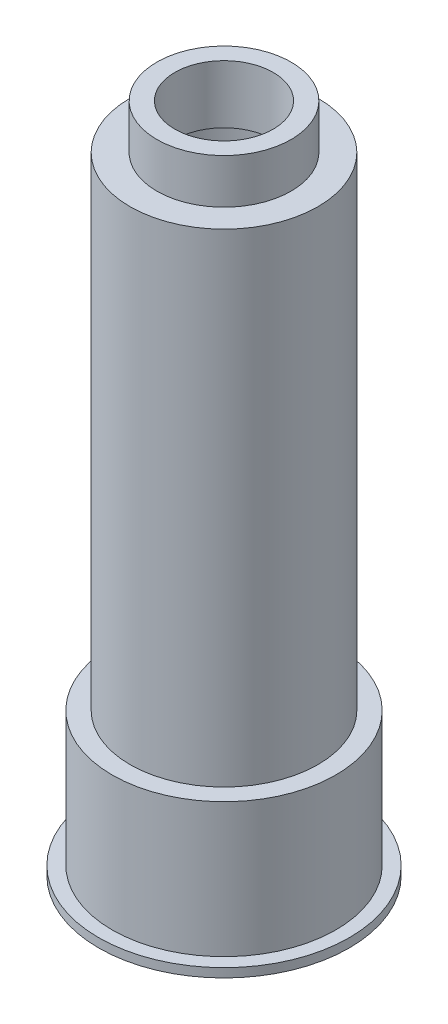
ISO-10303-21;
HEADER;
FILE_DESCRIPTION(('STEP AP214'),'2;1');
FILE_NAME('part.step','',(''),(''),'','','');
FILE_SCHEMA(('AUTOMOTIVE_DESIGN { 1 0 10303 214 1 1 1 1 }'));
ENDSEC;
DATA;
#1=APPLICATION_CONTEXT('core data for automotive mechanical design processes');
#2=APPLICATION_PROTOCOL_DEFINITION('international standard','automotive_design',2000,#1);
#3=PRODUCT_CONTEXT('',#1,'mechanical');
#4=PRODUCT('Part','Part','',(#3));
#5=PRODUCT_RELATED_PRODUCT_CATEGORY('part','',(#4));
#6=PRODUCT_DEFINITION_FORMATION('','',#4);
#7=PRODUCT_DEFINITION_CONTEXT('part definition',#1,'design');
#8=PRODUCT_DEFINITION('design','',#6,#7);
#9=PRODUCT_DEFINITION_SHAPE('','',#8);
#10=(LENGTH_UNIT() NAMED_UNIT(*) SI_UNIT(.MILLI.,.METRE.));
#11=(NAMED_UNIT(*) PLANE_ANGLE_UNIT() SI_UNIT($,.RADIAN.));
#12=(NAMED_UNIT(*) SI_UNIT($,.STERADIAN.) SOLID_ANGLE_UNIT());
#13=UNCERTAINTY_MEASURE_WITH_UNIT(LENGTH_MEASURE(1.E-05),#10,'distance_accuracy_value','');
#14=(GEOMETRIC_REPRESENTATION_CONTEXT(3) GLOBAL_UNCERTAINTY_ASSIGNED_CONTEXT((#13)) GLOBAL_UNIT_ASSIGNED_CONTEXT((#10,
#11,#12)) REPRESENTATION_CONTEXT('',''));
#15=CARTESIAN_POINT('',(0.,0.,0.));
#16=DIRECTION('',(0.,0.,1.));
#17=DIRECTION('',(1.,0.,0.));
#18=AXIS2_PLACEMENT_3D('',#15,#16,#17);
#19=CARTESIAN_POINT('',(0.,70.,0.));
#20=DIRECTION('',(0.,1.,0.));
#21=DIRECTION('',(0.,0.,1.));
#22=AXIS2_PLACEMENT_3D('',#19,#20,#21);
#23=PLANE('',#22);
#24=CARTESIAN_POINT('',(0.,70.,0.));
#25=DIRECTION('',(0.,1.,0.));
#26=DIRECTION('',(0.,0.,1.));
#27=AXIS2_PLACEMENT_3D('',#24,#25,#26);
#28=CIRCLE('',#27,10.5);
#29=CARTESIAN_POINT('',(0.,70.,10.5));
#30=VERTEX_POINT('',#29);
#31=EDGE_CURVE('E53',#30,#30,#28,.T.);
#32=ORIENTED_EDGE('',*,*,#31,.T.);
#33=EDGE_LOOP('',(#32));
#34=FACE_BOUND('',#33,.T.);
#35=CARTESIAN_POINT('',(0.,70.,0.));
#36=DIRECTION('',(0.,1.,0.));
#37=DIRECTION('',(0.,0.,1.));
#38=AXIS2_PLACEMENT_3D('',#35,#36,#37);
#39=CIRCLE('',#38,7.5);
#40=CARTESIAN_POINT('',(0.,70.,7.5));
#41=VERTEX_POINT('',#40);
#42=EDGE_CURVE('E71',#41,#41,#39,.T.);
#43=ORIENTED_EDGE('',*,*,#42,.F.);
#44=EDGE_LOOP('',(#43));
#45=FACE_BOUND('',#44,.T.);
#46=ADVANCED_FACE('F33',(#34,#45),#23,.T.);
#47=CARTESIAN_POINT('',(0.,70.,0.));
#48=DIRECTION('',(0.,-1.,0.));
#49=DIRECTION('',(0.,0.,-1.));
#50=AXIS2_PLACEMENT_3D('',#47,#48,#49);
#51=CYLINDRICAL_SURFACE('',#50,8.5);
#52=CARTESIAN_POINT('',(0.,14.5,0.));
#53=DIRECTION('',(0.,1.,0.));
#54=DIRECTION('',(0.,0.,1.));
#55=AXIS2_PLACEMENT_3D('',#52,#53,#54);
#56=CIRCLE('',#55,8.5);
#57=CARTESIAN_POINT('',(0.,14.5,8.5));
#58=VERTEX_POINT('',#57);
#59=EDGE_CURVE('E59',#58,#58,#56,.T.);
#60=ORIENTED_EDGE('',*,*,#59,.F.);
#61=EDGE_LOOP('',(#60));
#62=FACE_BOUND('',#61,.T.);
#63=CARTESIAN_POINT('',(0.,68.5,0.));
#64=DIRECTION('',(0.,1.,0.));
#65=DIRECTION('',(0.,0.,1.));
#66=AXIS2_PLACEMENT_3D('',#63,#64,#65);
#67=CIRCLE('',#66,8.5);
#68=CARTESIAN_POINT('',(0.,68.5,8.5));
#69=VERTEX_POINT('',#68);
#70=EDGE_CURVE('E62',#69,#69,#67,.T.);
#71=ORIENTED_EDGE('',*,*,#70,.T.);
#72=EDGE_LOOP('',(#71));
#73=FACE_BOUND('',#72,.T.);
#74=ADVANCED_FACE('F95',(#62,#73),#51,.F.);
#75=CARTESIAN_POINT('',(0.,16.,0.));
#76=DIRECTION('',(0.,-1.,0.));
#77=DIRECTION('',(0.,0.,-1.));
#78=AXIS2_PLACEMENT_3D('',#75,#76,#77);
#79=CYLINDRICAL_SURFACE('',#78,10.5);
#80=CARTESIAN_POINT('',(0.,1.,0.));
#81=DIRECTION('',(0.,1.,0.));
#82=DIRECTION('',(0.,0.,1.));
#83=AXIS2_PLACEMENT_3D('',#80,#81,#82);
#84=CIRCLE('',#83,10.5);
#85=CARTESIAN_POINT('',(0.,1.,10.5));
#86=VERTEX_POINT('',#85);
#87=EDGE_CURVE('E48',#86,#86,#84,.T.);
#88=ORIENTED_EDGE('',*,*,#87,.F.);
#89=EDGE_LOOP('',(#88));
#90=FACE_BOUND('',#89,.T.);
#91=CARTESIAN_POINT('',(0.,14.5,0.));
#92=DIRECTION('',(0.,1.,0.));
#93=DIRECTION('',(0.,0.,1.));
#94=AXIS2_PLACEMENT_3D('',#91,#92,#93);
#95=CIRCLE('',#94,10.5);
#96=CARTESIAN_POINT('',(0.,14.5,10.5));
#97=VERTEX_POINT('',#96);
#98=EDGE_CURVE('E56',#97,#97,#95,.T.);
#99=ORIENTED_EDGE('',*,*,#98,.T.);
#100=EDGE_LOOP('',(#99));
#101=FACE_BOUND('',#100,.T.);
#102=ADVANCED_FACE('F102',(#90,#101),#79,.F.);
#103=CARTESIAN_POINT('',(0.,16.,0.));
#104=DIRECTION('',(0.,1.,0.));
#105=DIRECTION('',(0.,0.,1.));
#106=AXIS2_PLACEMENT_3D('',#103,#104,#105);
#107=PLANE('',#106);
#108=CARTESIAN_POINT('',(0.,16.,0.));
#109=DIRECTION('',(0.,1.,0.));
#110=DIRECTION('',(0.,0.,1.));
#111=AXIS2_PLACEMENT_3D('',#108,#109,#110);
#112=CIRCLE('',#111,12.5);
#113=CARTESIAN_POINT('',(0.,16.,12.5));
#114=VERTEX_POINT('',#113);
#115=EDGE_CURVE('E11',#114,#114,#112,.T.);
#116=ORIENTED_EDGE('',*,*,#115,.T.);
#117=EDGE_LOOP('',(#116));
#118=FACE_BOUND('',#117,.T.);
#119=CARTESIAN_POINT('',(0.,16.,0.));
#120=DIRECTION('',(0.,1.,0.));
#121=DIRECTION('',(0.,0.,1.));
#122=AXIS2_PLACEMENT_3D('',#119,#120,#121);
#123=CIRCLE('',#122,10.5);
#124=CARTESIAN_POINT('',(0.,16.,10.5));
#125=VERTEX_POINT('',#124);
#126=EDGE_CURVE('E44',#125,#125,#123,.T.);
#127=ORIENTED_EDGE('',*,*,#126,.F.);
#128=EDGE_LOOP('',(#127));
#129=FACE_BOUND('',#128,.T.);
#130=ADVANCED_FACE('F115',(#118,#129),#107,.T.);
#131=CARTESIAN_POINT('',(0.,1.,0.));
#132=DIRECTION('',(0.,1.,0.));
#133=DIRECTION('',(0.,0.,1.));
#134=AXIS2_PLACEMENT_3D('',#131,#132,#133);
#135=PLANE('',#134);
#136=CARTESIAN_POINT('',(0.,1.,0.));
#137=DIRECTION('',(0.,1.,0.));
#138=DIRECTION('',(0.,0.,1.));
#139=AXIS2_PLACEMENT_3D('',#136,#137,#138);
#140=CIRCLE('',#139,12.5);
#141=CARTESIAN_POINT('',(0.,1.,12.5));
#142=VERTEX_POINT('',#141);
#143=EDGE_CURVE('E40',#142,#142,#140,.T.);
#144=ORIENTED_EDGE('',*,*,#143,.F.);
#145=EDGE_LOOP('',(#144));
#146=FACE_BOUND('',#145,.T.);
#147=ORIENTED_EDGE('',*,*,#87,.T.);
#148=EDGE_LOOP('',(#147));
#149=FACE_BOUND('',#148,.T.);
#150=ADVANCED_FACE('F117',(#146,#149),#135,.F.);
#151=CARTESIAN_POINT('',(0.,16.,0.));
#152=DIRECTION('',(0.,-1.,0.));
#153=DIRECTION('',(0.,0.,-1.));
#154=AXIS2_PLACEMENT_3D('',#151,#152,#153);
#155=CYLINDRICAL_SURFACE('',#154,12.5);
#156=ORIENTED_EDGE('',*,*,#115,.F.);
#157=EDGE_LOOP('',(#156));
#158=FACE_BOUND('',#157,.T.);
#159=ORIENTED_EDGE('',*,*,#143,.T.);
#160=EDGE_LOOP('',(#159));
#161=FACE_BOUND('',#160,.T.);
#162=ADVANCED_FACE('F35',(#158,#161),#155,.T.);
#163=CARTESIAN_POINT('',(0.,14.5,0.));
#164=DIRECTION('',(0.,1.,0.));
#165=DIRECTION('',(0.,0.,1.));
#166=AXIS2_PLACEMENT_3D('',#163,#164,#165);
#167=PLANE('',#166);
#168=ORIENTED_EDGE('',*,*,#98,.F.);
#169=EDGE_LOOP('',(#168));
#170=FACE_BOUND('',#169,.T.);
#171=ORIENTED_EDGE('',*,*,#59,.T.);
#172=EDGE_LOOP('',(#171));
#173=FACE_BOUND('',#172,.T.);
#174=ADVANCED_FACE('F108',(#170,#173),#167,.F.);
#175=CARTESIAN_POINT('',(0.,70.,0.));
#176=DIRECTION('',(0.,-1.,0.));
#177=DIRECTION('',(0.,0.,-1.));
#178=AXIS2_PLACEMENT_3D('',#175,#176,#177);
#179=CYLINDRICAL_SURFACE('',#178,10.5);
#180=ORIENTED_EDGE('',*,*,#126,.T.);
#181=EDGE_LOOP('',(#180));
#182=FACE_BOUND('',#181,.T.);
#183=ORIENTED_EDGE('',*,*,#31,.F.);
#184=EDGE_LOOP('',(#183));
#185=FACE_BOUND('',#184,.T.);
#186=ADVANCED_FACE('F109',(#182,#185),#179,.T.);
#187=CARTESIAN_POINT('',(0.,68.5,0.));
#188=DIRECTION('',(0.,1.,0.));
#189=DIRECTION('',(0.,0.,1.));
#190=AXIS2_PLACEMENT_3D('',#187,#188,#189);
#191=PLANE('',#190);
#192=ORIENTED_EDGE('',*,*,#70,.F.);
#193=EDGE_LOOP('',(#192));
#194=FACE_BOUND('',#193,.T.);
#195=CARTESIAN_POINT('',(0.,68.5,0.));
#196=DIRECTION('',(0.,1.,0.));
#197=DIRECTION('',(0.,0.,1.));
#198=AXIS2_PLACEMENT_3D('',#195,#196,#197);
#199=CIRCLE('',#198,5.5);
#200=CARTESIAN_POINT('',(0.,68.5,5.5));
#201=VERTEX_POINT('',#200);
#202=EDGE_CURVE('E65',#201,#201,#199,.T.);
#203=ORIENTED_EDGE('',*,*,#202,.T.);
#204=EDGE_LOOP('',(#203));
#205=FACE_BOUND('',#204,.T.);
#206=ADVANCED_FACE('F91',(#194,#205),#191,.F.);
#207=CARTESIAN_POINT('',(0.,70.,0.));
#208=DIRECTION('',(0.,-1.,0.));
#209=DIRECTION('',(0.,0.,-1.));
#210=AXIS2_PLACEMENT_3D('',#207,#208,#209);
#211=CYLINDRICAL_SURFACE('',#210,5.5);
#212=ORIENTED_EDGE('',*,*,#202,.F.);
#213=EDGE_LOOP('',(#212));
#214=FACE_BOUND('',#213,.T.);
#215=CARTESIAN_POINT('',(0.,75.,0.));
#216=DIRECTION('',(0.,1.,0.));
#217=DIRECTION('',(0.,0.,1.));
#218=AXIS2_PLACEMENT_3D('',#215,#216,#217);
#219=CIRCLE('',#218,5.5);
#220=CARTESIAN_POINT('',(0.,75.,5.5));
#221=VERTEX_POINT('',#220);
#222=EDGE_CURVE('E74',#221,#221,#219,.T.);
#223=ORIENTED_EDGE('',*,*,#222,.T.);
#224=EDGE_LOOP('',(#223));
#225=FACE_BOUND('',#224,.T.);
#226=ADVANCED_FACE('F78',(#214,#225),#211,.F.);
#227=CARTESIAN_POINT('',(0.,75.,0.));
#228=DIRECTION('',(0.,1.,0.));
#229=DIRECTION('',(0.,0.,1.));
#230=AXIS2_PLACEMENT_3D('',#227,#228,#229);
#231=PLANE('',#230);
#232=CARTESIAN_POINT('',(0.,75.,0.));
#233=DIRECTION('',(0.,1.,0.));
#234=DIRECTION('',(0.,0.,1.));
#235=AXIS2_PLACEMENT_3D('',#232,#233,#234);
#236=CIRCLE('',#235,7.5);
#237=CARTESIAN_POINT('',(0.,75.,7.5));
#238=VERTEX_POINT('',#237);
#239=EDGE_CURVE('E68',#238,#238,#236,.T.);
#240=ORIENTED_EDGE('',*,*,#239,.T.);
#241=EDGE_LOOP('',(#240));
#242=FACE_BOUND('',#241,.T.);
#243=ORIENTED_EDGE('',*,*,#222,.F.);
#244=EDGE_LOOP('',(#243));
#245=FACE_BOUND('',#244,.T.);
#246=ADVANCED_FACE('F80',(#242,#245),#231,.T.);
#247=CARTESIAN_POINT('',(0.,75.,0.));
#248=DIRECTION('',(0.,-1.,0.));
#249=DIRECTION('',(0.,0.,-1.));
#250=AXIS2_PLACEMENT_3D('',#247,#248,#249);
#251=CYLINDRICAL_SURFACE('',#250,7.5);
#252=ORIENTED_EDGE('',*,*,#239,.F.);
#253=EDGE_LOOP('',(#252));
#254=FACE_BOUND('',#253,.T.);
#255=ORIENTED_EDGE('',*,*,#42,.T.);
#256=EDGE_LOOP('',(#255));
#257=FACE_BOUND('',#256,.T.);
#258=ADVANCED_FACE('F82',(#254,#257),#251,.T.);
#259=CLOSED_SHELL('',(#46,#74,#102,#130,#150,#162,#174,#186,#206,#226,#246,#258));
#260=MANIFOLD_SOLID_BREP('B2',#259);
#261=CARTESIAN_POINT('',(0.,1.,0.));
#262=DIRECTION('',(0.,1.,0.));
#263=DIRECTION('',(0.,0.,1.));
#264=AXIS2_PLACEMENT_3D('',#261,#262,#263);
#265=PLANE('',#264);
#266=CARTESIAN_POINT('',(0.,1.,0.));
#267=DIRECTION('',(0.,1.,0.));
#268=DIRECTION('',(0.,0.,1.));
#269=AXIS2_PLACEMENT_3D('',#266,#267,#268);
#270=CIRCLE('',#269,14.);
#271=CARTESIAN_POINT('',(0.,1.,14.));
#272=VERTEX_POINT('',#271);
#273=EDGE_CURVE('E32',#272,#272,#270,.T.);
#274=ORIENTED_EDGE('',*,*,#273,.T.);
#275=EDGE_LOOP('',(#274));
#276=FACE_BOUND('',#275,.T.);
#277=CARTESIAN_POINT('',(0.,1.,0.));
#278=DIRECTION('',(0.,1.,0.));
#279=DIRECTION('',(0.,0.,1.));
#280=AXIS2_PLACEMENT_3D('',#277,#278,#279);
#281=CIRCLE('',#280,12.5);
#282=CARTESIAN_POINT('',(0.,1.,12.5));
#283=VERTEX_POINT('',#282);
#284=EDGE_CURVE('E207',#283,#283,#281,.T.);
#285=ORIENTED_EDGE('',*,*,#284,.F.);
#286=EDGE_LOOP('',(#285));
#287=FACE_BOUND('',#286,.T.);
#288=ADVANCED_FACE('F196',(#276,#287),#265,.T.);
#289=CARTESIAN_POINT('',(0.,0.,0.));
#290=DIRECTION('',(0.,1.,0.));
#291=DIRECTION('',(0.,0.,1.));
#292=AXIS2_PLACEMENT_3D('',#289,#290,#291);
#293=PLANE('',#292);
#294=CARTESIAN_POINT('',(0.,0.,0.));
#295=DIRECTION('',(0.,1.,0.));
#296=DIRECTION('',(0.,0.,1.));
#297=AXIS2_PLACEMENT_3D('',#294,#295,#296);
#298=CIRCLE('',#297,14.);
#299=CARTESIAN_POINT('',(0.,0.,14.));
#300=VERTEX_POINT('',#299);
#301=EDGE_CURVE('E203',#300,#300,#298,.T.);
#302=ORIENTED_EDGE('',*,*,#301,.F.);
#303=EDGE_LOOP('',(#302));
#304=FACE_BOUND('',#303,.T.);
#305=CARTESIAN_POINT('',(0.,0.,0.));
#306=DIRECTION('',(0.,1.,0.));
#307=DIRECTION('',(0.,0.,1.));
#308=AXIS2_PLACEMENT_3D('',#305,#306,#307);
#309=CIRCLE('',#308,12.5);
#310=CARTESIAN_POINT('',(0.,0.,12.5));
#311=VERTEX_POINT('',#310);
#312=EDGE_CURVE('E211',#311,#311,#309,.T.);
#313=ORIENTED_EDGE('',*,*,#312,.T.);
#314=EDGE_LOOP('',(#313));
#315=FACE_BOUND('',#314,.T.);
#316=ADVANCED_FACE('F217',(#304,#315),#293,.F.);
#317=CARTESIAN_POINT('',(0.,1.,0.));
#318=DIRECTION('',(0.,-1.,0.));
#319=DIRECTION('',(0.,0.,-1.));
#320=AXIS2_PLACEMENT_3D('',#317,#318,#319);
#321=CYLINDRICAL_SURFACE('',#320,14.);
#322=ORIENTED_EDGE('',*,*,#273,.F.);
#323=EDGE_LOOP('',(#322));
#324=FACE_BOUND('',#323,.T.);
#325=ORIENTED_EDGE('',*,*,#301,.T.);
#326=EDGE_LOOP('',(#325));
#327=FACE_BOUND('',#326,.T.);
#328=ADVANCED_FACE('F198',(#324,#327),#321,.T.);
#329=CARTESIAN_POINT('',(0.,1.,0.));
#330=DIRECTION('',(0.,-1.,0.));
#331=DIRECTION('',(0.,0.,-1.));
#332=AXIS2_PLACEMENT_3D('',#329,#330,#331);
#333=CYLINDRICAL_SURFACE('',#332,12.5);
#334=ORIENTED_EDGE('',*,*,#284,.T.);
#335=EDGE_LOOP('',(#334));
#336=FACE_BOUND('',#335,.T.);
#337=ORIENTED_EDGE('',*,*,#312,.F.);
#338=EDGE_LOOP('',(#337));
#339=FACE_BOUND('',#338,.T.);
#340=ADVANCED_FACE('F219',(#336,#339),#333,.F.);
#341=CLOSED_SHELL('',(#288,#316,#328,#340));
#342=MANIFOLD_SOLID_BREP('B6',#341);
#343=ADVANCED_BREP_SHAPE_REPRESENTATION('',(#18,#260,#342),#14);
#344=SHAPE_DEFINITION_REPRESENTATION(#9,#343);
ENDSEC;
END-ISO-10303-21;
